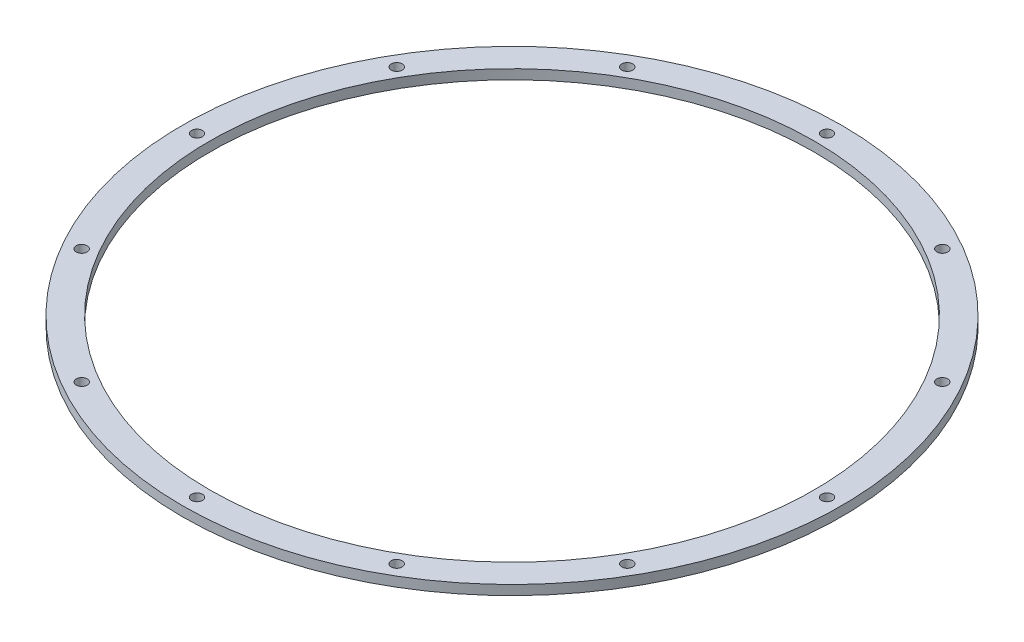
ISO-10303-21;
HEADER;
FILE_DESCRIPTION(('STEP AP214'),'2;1');
FILE_NAME('part.step','',(''),(''),'','','');
FILE_SCHEMA(('AUTOMOTIVE_DESIGN { 1 0 10303 214 1 1 1 1 }'));
ENDSEC;
DATA;
#1=APPLICATION_CONTEXT('core data for automotive mechanical design processes');
#2=APPLICATION_PROTOCOL_DEFINITION('international standard','automotive_design',2000,#1);
#3=PRODUCT_CONTEXT('',#1,'mechanical');
#4=PRODUCT('Part','Part','',(#3));
#5=PRODUCT_RELATED_PRODUCT_CATEGORY('part','',(#4));
#6=PRODUCT_DEFINITION_FORMATION('','',#4);
#7=PRODUCT_DEFINITION_CONTEXT('part definition',#1,'design');
#8=PRODUCT_DEFINITION('design','',#6,#7);
#9=PRODUCT_DEFINITION_SHAPE('','',#8);
#10=(LENGTH_UNIT() NAMED_UNIT(*) SI_UNIT(.MILLI.,.METRE.));
#11=(NAMED_UNIT(*) PLANE_ANGLE_UNIT() SI_UNIT($,.RADIAN.));
#12=(NAMED_UNIT(*) SI_UNIT($,.STERADIAN.) SOLID_ANGLE_UNIT());
#13=UNCERTAINTY_MEASURE_WITH_UNIT(LENGTH_MEASURE(1.E-05),#10,'distance_accuracy_value','');
#14=(GEOMETRIC_REPRESENTATION_CONTEXT(3) GLOBAL_UNCERTAINTY_ASSIGNED_CONTEXT((#13)) GLOBAL_UNIT_ASSIGNED_CONTEXT((#10,
#11,#12)) REPRESENTATION_CONTEXT('',''));
#15=CARTESIAN_POINT('',(0.,0.,0.));
#16=DIRECTION('',(0.,0.,1.));
#17=DIRECTION('',(1.,0.,0.));
#18=AXIS2_PLACEMENT_3D('',#15,#16,#17);
#19=CARTESIAN_POINT('',(0.,3.,0.));
#20=DIRECTION('',(0.,-1.,0.));
#21=DIRECTION('',(0.,0.,-1.));
#22=AXIS2_PLACEMENT_3D('',#19,#20,#21);
#23=CYLINDRICAL_SURFACE('',#22,94.);
#24=CARTESIAN_POINT('',(0.,3.,0.));
#25=DIRECTION('',(0.,1.,0.));
#26=DIRECTION('',(0.,0.,1.));
#27=AXIS2_PLACEMENT_3D('',#24,#25,#26);
#28=CIRCLE('',#27,94.);
#29=CARTESIAN_POINT('',(0.,3.,94.));
#30=VERTEX_POINT('',#29);
#31=EDGE_CURVE('E40',#30,#30,#28,.T.);
#32=ORIENTED_EDGE('',*,*,#31,.T.);
#33=EDGE_LOOP('',(#32));
#34=FACE_BOUND('',#33,.T.);
#35=CARTESIAN_POINT('',(0.,0.,0.));
#36=DIRECTION('',(0.,1.,0.));
#37=DIRECTION('',(0.,0.,1.));
#38=AXIS2_PLACEMENT_3D('',#35,#36,#37);
#39=CIRCLE('',#38,94.);
#40=CARTESIAN_POINT('',(0.,0.,94.));
#41=VERTEX_POINT('',#40);
#42=EDGE_CURVE('E84',#41,#41,#39,.T.);
#43=ORIENTED_EDGE('',*,*,#42,.F.);
#44=EDGE_LOOP('',(#43));
#45=FACE_BOUND('',#44,.T.);
#46=ADVANCED_FACE('F32',(#34,#45),#23,.F.);
#47=CARTESIAN_POINT('',(0.,3.,-97.974));
#48=DIRECTION('',(0.,-1.,0.));
#49=DIRECTION('',(0.,0.,-1.));
#50=AXIS2_PLACEMENT_3D('',#47,#48,#49);
#51=CYLINDRICAL_SURFACE('',#50,1.70000000000001);
#52=CARTESIAN_POINT('',(0.,3.,-97.974));
#53=DIRECTION('',(0.,1.,0.));
#54=DIRECTION('',(0.,0.,1.));
#55=AXIS2_PLACEMENT_3D('',#52,#53,#54);
#56=CIRCLE('',#55,1.70000000000001);
#57=CARTESIAN_POINT('',(0.,3.,-96.274));
#58=VERTEX_POINT('',#57);
#59=EDGE_CURVE('E45',#58,#58,#56,.T.);
#60=ORIENTED_EDGE('',*,*,#59,.T.);
#61=EDGE_LOOP('',(#60));
#62=FACE_BOUND('',#61,.T.);
#63=CARTESIAN_POINT('',(0.,0.,-97.974));
#64=DIRECTION('',(0.,1.,0.));
#65=DIRECTION('',(0.,0.,1.));
#66=AXIS2_PLACEMENT_3D('',#63,#64,#65);
#67=CIRCLE('',#66,1.70000000000001);
#68=CARTESIAN_POINT('',(0.,0.,-96.274));
#69=VERTEX_POINT('',#68);
#70=EDGE_CURVE('E82',#69,#69,#67,.T.);
#71=ORIENTED_EDGE('',*,*,#70,.F.);
#72=EDGE_LOOP('',(#71));
#73=FACE_BOUND('',#72,.T.);
#74=ADVANCED_FACE('F129',(#62,#73),#51,.F.);
#75=CARTESIAN_POINT('',(48.9870000000005,3.,-84.8479729103784));
#76=DIRECTION('',(0.,-1.,0.));
#77=DIRECTION('',(0.,0.,-1.));
#78=AXIS2_PLACEMENT_3D('',#75,#76,#77);
#79=CYLINDRICAL_SURFACE('',#78,1.7);
#80=CARTESIAN_POINT('',(48.9870000000005,3.,-84.8479729103784));
#81=DIRECTION('',(0.,1.,0.));
#82=DIRECTION('',(0.,0.,1.));
#83=AXIS2_PLACEMENT_3D('',#80,#81,#82);
#84=CIRCLE('',#83,1.7);
#85=CARTESIAN_POINT('',(48.9870000000005,3.,-83.1479729103784));
#86=VERTEX_POINT('',#85);
#87=EDGE_CURVE('E124',#86,#86,#84,.T.);
#88=ORIENTED_EDGE('',*,*,#87,.T.);
#89=EDGE_LOOP('',(#88));
#90=FACE_BOUND('',#89,.T.);
#91=CARTESIAN_POINT('',(48.9870000000005,0.,-84.8479729103784));
#92=DIRECTION('',(0.,1.,0.));
#93=DIRECTION('',(0.,0.,1.));
#94=AXIS2_PLACEMENT_3D('',#91,#92,#93);
#95=CIRCLE('',#94,1.7);
#96=CARTESIAN_POINT('',(48.9870000000005,0.,-83.1479729103784));
#97=VERTEX_POINT('',#96);
#98=EDGE_CURVE('E79',#97,#97,#95,.T.);
#99=ORIENTED_EDGE('',*,*,#98,.F.);
#100=EDGE_LOOP('',(#99));
#101=FACE_BOUND('',#100,.T.);
#102=ADVANCED_FACE('F147',(#90,#101),#79,.F.);
#103=CARTESIAN_POINT('',(84.8479729103784,3.,-48.9870000000031));
#104=DIRECTION('',(0.,-1.,0.));
#105=DIRECTION('',(0.,0.,-1.));
#106=AXIS2_PLACEMENT_3D('',#103,#104,#105);
#107=CYLINDRICAL_SURFACE('',#106,1.7);
#108=CARTESIAN_POINT('',(84.8479729103784,3.,-48.9870000000031));
#109=DIRECTION('',(0.,1.,0.));
#110=DIRECTION('',(0.,0.,1.));
#111=AXIS2_PLACEMENT_3D('',#108,#109,#110);
#112=CIRCLE('',#111,1.7);
#113=CARTESIAN_POINT('',(84.8479729103784,3.,-47.2870000000031));
#114=VERTEX_POINT('',#113);
#115=EDGE_CURVE('E121',#114,#114,#112,.T.);
#116=ORIENTED_EDGE('',*,*,#115,.T.);
#117=EDGE_LOOP('',(#116));
#118=FACE_BOUND('',#117,.T.);
#119=CARTESIAN_POINT('',(84.8479729103784,0.,-48.9870000000031));
#120=DIRECTION('',(0.,1.,0.));
#121=DIRECTION('',(0.,0.,1.));
#122=AXIS2_PLACEMENT_3D('',#119,#120,#121);
#123=CIRCLE('',#122,1.7);
#124=CARTESIAN_POINT('',(84.8479729103784,0.,-47.2870000000031));
#125=VERTEX_POINT('',#124);
#126=EDGE_CURVE('E76',#125,#125,#123,.T.);
#127=ORIENTED_EDGE('',*,*,#126,.F.);
#128=EDGE_LOOP('',(#127));
#129=FACE_BOUND('',#128,.T.);
#130=ADVANCED_FACE('F154',(#118,#129),#107,.F.);
#131=CARTESIAN_POINT('',(97.9740000000036,3.,-3.60894813406599E-12));
#132=DIRECTION('',(0.,-1.,0.));
#133=DIRECTION('',(0.,0.,-1.));
#134=AXIS2_PLACEMENT_3D('',#131,#132,#133);
#135=CYLINDRICAL_SURFACE('',#134,1.7);
#136=CARTESIAN_POINT('',(97.9740000000036,3.,-3.60894813406599E-12));
#137=DIRECTION('',(0.,1.,0.));
#138=DIRECTION('',(0.,0.,1.));
#139=AXIS2_PLACEMENT_3D('',#136,#137,#138);
#140=CIRCLE('',#139,1.7);
#141=CARTESIAN_POINT('',(97.9740000000036,3.,1.69999999999639));
#142=VERTEX_POINT('',#141);
#143=EDGE_CURVE('E118',#142,#142,#140,.T.);
#144=ORIENTED_EDGE('',*,*,#143,.T.);
#145=EDGE_LOOP('',(#144));
#146=FACE_BOUND('',#145,.T.);
#147=CARTESIAN_POINT('',(97.9740000000036,0.,-3.60894813406599E-12));
#148=DIRECTION('',(0.,1.,0.));
#149=DIRECTION('',(0.,0.,1.));
#150=AXIS2_PLACEMENT_3D('',#147,#148,#149);
#151=CIRCLE('',#150,1.7);
#152=CARTESIAN_POINT('',(97.9740000000036,0.,1.69999999999639));
#153=VERTEX_POINT('',#152);
#154=EDGE_CURVE('E73',#153,#153,#151,.T.);
#155=ORIENTED_EDGE('',*,*,#154,.F.);
#156=EDGE_LOOP('',(#155));
#157=FACE_BOUND('',#156,.T.);
#158=ADVANCED_FACE('F158',(#146,#157),#135,.F.);
#159=CARTESIAN_POINT('',(84.847972910382,3.,48.9869999999969));
#160=DIRECTION('',(0.,-1.,0.));
#161=DIRECTION('',(0.,0.,-1.));
#162=AXIS2_PLACEMENT_3D('',#159,#160,#161);
#163=CYLINDRICAL_SURFACE('',#162,1.7);
#164=CARTESIAN_POINT('',(84.847972910382,3.,48.9869999999969));
#165=DIRECTION('',(0.,1.,0.));
#166=DIRECTION('',(0.,0.,1.));
#167=AXIS2_PLACEMENT_3D('',#164,#165,#166);
#168=CIRCLE('',#167,1.7);
#169=CARTESIAN_POINT('',(84.847972910382,3.,50.6869999999969));
#170=VERTEX_POINT('',#169);
#171=EDGE_CURVE('E115',#170,#170,#168,.T.);
#172=ORIENTED_EDGE('',*,*,#171,.T.);
#173=EDGE_LOOP('',(#172));
#174=FACE_BOUND('',#173,.T.);
#175=CARTESIAN_POINT('',(84.847972910382,0.,48.9869999999969));
#176=DIRECTION('',(0.,1.,0.));
#177=DIRECTION('',(0.,0.,1.));
#178=AXIS2_PLACEMENT_3D('',#175,#176,#177);
#179=CIRCLE('',#178,1.7);
#180=CARTESIAN_POINT('',(84.847972910382,0.,50.6869999999969));
#181=VERTEX_POINT('',#180);
#182=EDGE_CURVE('E70',#181,#181,#179,.T.);
#183=ORIENTED_EDGE('',*,*,#182,.F.);
#184=EDGE_LOOP('',(#183));
#185=FACE_BOUND('',#184,.T.);
#186=ADVANCED_FACE('F162',(#174,#185),#163,.F.);
#187=CARTESIAN_POINT('',(48.9870000000068,3.,84.8479729103748));
#188=DIRECTION('',(0.,-1.,0.));
#189=DIRECTION('',(0.,0.,-1.));
#190=AXIS2_PLACEMENT_3D('',#187,#188,#189);
#191=CYLINDRICAL_SURFACE('',#190,1.7);
#192=CARTESIAN_POINT('',(48.9870000000068,3.,84.8479729103748));
#193=DIRECTION('',(0.,1.,0.));
#194=DIRECTION('',(0.,0.,1.));
#195=AXIS2_PLACEMENT_3D('',#192,#193,#194);
#196=CIRCLE('',#195,1.7);
#197=CARTESIAN_POINT('',(48.9870000000068,3.,86.5479729103748));
#198=VERTEX_POINT('',#197);
#199=EDGE_CURVE('E112',#198,#198,#196,.T.);
#200=ORIENTED_EDGE('',*,*,#199,.T.);
#201=EDGE_LOOP('',(#200));
#202=FACE_BOUND('',#201,.T.);
#203=CARTESIAN_POINT('',(48.9870000000068,0.,84.8479729103748));
#204=DIRECTION('',(0.,1.,0.));
#205=DIRECTION('',(0.,0.,1.));
#206=AXIS2_PLACEMENT_3D('',#203,#204,#205);
#207=CIRCLE('',#206,1.7);
#208=CARTESIAN_POINT('',(48.9870000000068,0.,86.5479729103748));
#209=VERTEX_POINT('',#208);
#210=EDGE_CURVE('E67',#209,#209,#207,.T.);
#211=ORIENTED_EDGE('',*,*,#210,.F.);
#212=EDGE_LOOP('',(#211));
#213=FACE_BOUND('',#212,.T.);
#214=ADVANCED_FACE('F166',(#202,#213),#191,.F.);
#215=CARTESIAN_POINT('',(7.21789626813198E-12,3.,97.974));
#216=DIRECTION('',(0.,-1.,0.));
#217=DIRECTION('',(0.,0.,-1.));
#218=AXIS2_PLACEMENT_3D('',#215,#216,#217);
#219=CYLINDRICAL_SURFACE('',#218,1.69999999999999);
#220=CARTESIAN_POINT('',(7.21789626813198E-12,3.,97.974));
#221=DIRECTION('',(0.,1.,0.));
#222=DIRECTION('',(0.,0.,1.));
#223=AXIS2_PLACEMENT_3D('',#220,#221,#222);
#224=CIRCLE('',#223,1.69999999999999);
#225=CARTESIAN_POINT('',(7.21789626813198E-12,3.,99.674));
#226=VERTEX_POINT('',#225);
#227=EDGE_CURVE('E109',#226,#226,#224,.T.);
#228=ORIENTED_EDGE('',*,*,#227,.T.);
#229=EDGE_LOOP('',(#228));
#230=FACE_BOUND('',#229,.T.);
#231=CARTESIAN_POINT('',(7.21789626813198E-12,0.,97.974));
#232=DIRECTION('',(0.,1.,0.));
#233=DIRECTION('',(0.,0.,1.));
#234=AXIS2_PLACEMENT_3D('',#231,#232,#233);
#235=CIRCLE('',#234,1.69999999999999);
#236=CARTESIAN_POINT('',(7.21789626813198E-12,0.,99.674));
#237=VERTEX_POINT('',#236);
#238=EDGE_CURVE('E64',#237,#237,#235,.T.);
#239=ORIENTED_EDGE('',*,*,#238,.F.);
#240=EDGE_LOOP('',(#239));
#241=FACE_BOUND('',#240,.T.);
#242=ADVANCED_FACE('F170',(#230,#241),#219,.F.);
#243=CARTESIAN_POINT('',(-48.9869999999933,3.,84.8479729103784));
#244=DIRECTION('',(0.,-1.,0.));
#245=DIRECTION('',(0.,0.,-1.));
#246=AXIS2_PLACEMENT_3D('',#243,#244,#245);
#247=CYLINDRICAL_SURFACE('',#246,1.7);
#248=CARTESIAN_POINT('',(-48.9869999999933,3.,84.8479729103784));
#249=DIRECTION('',(0.,1.,0.));
#250=DIRECTION('',(0.,0.,1.));
#251=AXIS2_PLACEMENT_3D('',#248,#249,#250);
#252=CIRCLE('',#251,1.7);
#253=CARTESIAN_POINT('',(-48.9869999999933,3.,86.5479729103784));
#254=VERTEX_POINT('',#253);
#255=EDGE_CURVE('E106',#254,#254,#252,.T.);
#256=ORIENTED_EDGE('',*,*,#255,.T.);
#257=EDGE_LOOP('',(#256));
#258=FACE_BOUND('',#257,.T.);
#259=CARTESIAN_POINT('',(-48.9869999999933,0.,84.8479729103784));
#260=DIRECTION('',(0.,1.,0.));
#261=DIRECTION('',(0.,0.,1.));
#262=AXIS2_PLACEMENT_3D('',#259,#260,#261);
#263=CIRCLE('',#262,1.7);
#264=CARTESIAN_POINT('',(-48.9869999999933,0.,86.5479729103784));
#265=VERTEX_POINT('',#264);
#266=EDGE_CURVE('E61',#265,#265,#263,.T.);
#267=ORIENTED_EDGE('',*,*,#266,.F.);
#268=EDGE_LOOP('',(#267));
#269=FACE_BOUND('',#268,.T.);
#270=ADVANCED_FACE('F174',(#258,#269),#247,.F.);
#271=CARTESIAN_POINT('',(-84.8479729103712,3.,48.9870000000032));
#272=DIRECTION('',(0.,-1.,0.));
#273=DIRECTION('',(0.,0.,-1.));
#274=AXIS2_PLACEMENT_3D('',#271,#272,#273);
#275=CYLINDRICAL_SURFACE('',#274,1.7);
#276=CARTESIAN_POINT('',(-84.8479729103712,3.,48.9870000000032));
#277=DIRECTION('',(0.,1.,0.));
#278=DIRECTION('',(0.,0.,1.));
#279=AXIS2_PLACEMENT_3D('',#276,#277,#278);
#280=CIRCLE('',#279,1.7);
#281=CARTESIAN_POINT('',(-84.8479729103712,3.,50.6870000000032));
#282=VERTEX_POINT('',#281);
#283=EDGE_CURVE('E103',#282,#282,#280,.T.);
#284=ORIENTED_EDGE('',*,*,#283,.T.);
#285=EDGE_LOOP('',(#284));
#286=FACE_BOUND('',#285,.T.);
#287=CARTESIAN_POINT('',(-84.8479729103712,0.,48.9870000000032));
#288=DIRECTION('',(0.,1.,0.));
#289=DIRECTION('',(0.,0.,1.));
#290=AXIS2_PLACEMENT_3D('',#287,#288,#289);
#291=CIRCLE('',#290,1.7);
#292=CARTESIAN_POINT('',(-84.8479729103712,0.,50.6870000000032));
#293=VERTEX_POINT('',#292);
#294=EDGE_CURVE('E58',#293,#293,#291,.T.);
#295=ORIENTED_EDGE('',*,*,#294,.F.);
#296=EDGE_LOOP('',(#295));
#297=FACE_BOUND('',#296,.T.);
#298=ADVANCED_FACE('F178',(#286,#297),#275,.F.);
#299=CARTESIAN_POINT('',(-97.9739999999964,3.,3.62094648861596E-12));
#300=DIRECTION('',(0.,-1.,0.));
#301=DIRECTION('',(0.,0.,-1.));
#302=AXIS2_PLACEMENT_3D('',#299,#300,#301);
#303=CYLINDRICAL_SURFACE('',#302,1.7);
#304=CARTESIAN_POINT('',(-97.9739999999964,3.,3.62094648861596E-12));
#305=DIRECTION('',(0.,1.,0.));
#306=DIRECTION('',(0.,0.,1.));
#307=AXIS2_PLACEMENT_3D('',#304,#305,#306);
#308=CIRCLE('',#307,1.7);
#309=CARTESIAN_POINT('',(-97.9739999999964,3.,1.70000000000362));
#310=VERTEX_POINT('',#309);
#311=EDGE_CURVE('E98',#310,#310,#308,.T.);
#312=ORIENTED_EDGE('',*,*,#311,.T.);
#313=EDGE_LOOP('',(#312));
#314=FACE_BOUND('',#313,.T.);
#315=CARTESIAN_POINT('',(-97.9739999999964,0.,3.62094648861596E-12));
#316=DIRECTION('',(0.,1.,0.));
#317=DIRECTION('',(0.,0.,1.));
#318=AXIS2_PLACEMENT_3D('',#315,#316,#317);
#319=CIRCLE('',#318,1.7);
#320=CARTESIAN_POINT('',(-97.9739999999964,0.,1.70000000000362));
#321=VERTEX_POINT('',#320);
#322=EDGE_CURVE('E55',#321,#321,#319,.T.);
#323=ORIENTED_EDGE('',*,*,#322,.F.);
#324=EDGE_LOOP('',(#323));
#325=FACE_BOUND('',#324,.T.);
#326=ADVANCED_FACE('F182',(#314,#325),#303,.F.);
#327=CARTESIAN_POINT('',(-84.8479729103748,3.,-48.9869999999968));
#328=DIRECTION('',(0.,-1.,0.));
#329=DIRECTION('',(0.,0.,-1.));
#330=AXIS2_PLACEMENT_3D('',#327,#328,#329);
#331=CYLINDRICAL_SURFACE('',#330,1.7);
#332=CARTESIAN_POINT('',(-84.8479729103748,3.,-48.9869999999968));
#333=DIRECTION('',(0.,1.,0.));
#334=DIRECTION('',(0.,0.,1.));
#335=AXIS2_PLACEMENT_3D('',#332,#333,#334);
#336=CIRCLE('',#335,1.7);
#337=CARTESIAN_POINT('',(-84.8479729103748,3.,-47.2869999999968));
#338=VERTEX_POINT('',#337);
#339=EDGE_CURVE('E93',#338,#338,#336,.T.);
#340=ORIENTED_EDGE('',*,*,#339,.T.);
#341=EDGE_LOOP('',(#340));
#342=FACE_BOUND('',#341,.T.);
#343=CARTESIAN_POINT('',(-84.8479729103748,0.,-48.9869999999968));
#344=DIRECTION('',(0.,1.,0.));
#345=DIRECTION('',(0.,0.,1.));
#346=AXIS2_PLACEMENT_3D('',#343,#344,#345);
#347=CIRCLE('',#346,1.7);
#348=CARTESIAN_POINT('',(-84.8479729103748,0.,-47.2869999999968));
#349=VERTEX_POINT('',#348);
#350=EDGE_CURVE('E52',#349,#349,#347,.T.);
#351=ORIENTED_EDGE('',*,*,#350,.F.);
#352=EDGE_LOOP('',(#351));
#353=FACE_BOUND('',#352,.T.);
#354=ADVANCED_FACE('F185',(#342,#353),#331,.F.);
#355=CARTESIAN_POINT('',(-48.9869999999996,3.,-84.8479729103748));
#356=DIRECTION('',(0.,-1.,0.));
#357=DIRECTION('',(0.,0.,-1.));
#358=AXIS2_PLACEMENT_3D('',#355,#356,#357);
#359=CYLINDRICAL_SURFACE('',#358,1.7);
#360=CARTESIAN_POINT('',(-48.9869999999996,3.,-84.8479729103748));
#361=DIRECTION('',(0.,1.,0.));
#362=DIRECTION('',(0.,0.,1.));
#363=AXIS2_PLACEMENT_3D('',#360,#361,#362);
#364=CIRCLE('',#363,1.7);
#365=CARTESIAN_POINT('',(-48.9869999999996,3.,-83.1479729103748));
#366=VERTEX_POINT('',#365);
#367=EDGE_CURVE('E89',#366,#366,#364,.T.);
#368=ORIENTED_EDGE('',*,*,#367,.T.);
#369=EDGE_LOOP('',(#368));
#370=FACE_BOUND('',#369,.T.);
#371=CARTESIAN_POINT('',(-48.9869999999996,0.,-84.8479729103748));
#372=DIRECTION('',(0.,1.,0.));
#373=DIRECTION('',(0.,0.,1.));
#374=AXIS2_PLACEMENT_3D('',#371,#372,#373);
#375=CIRCLE('',#374,1.7);
#376=CARTESIAN_POINT('',(-48.9869999999996,0.,-83.1479729103748));
#377=VERTEX_POINT('',#376);
#378=EDGE_CURVE('E49',#377,#377,#375,.T.);
#379=ORIENTED_EDGE('',*,*,#378,.F.);
#380=EDGE_LOOP('',(#379));
#381=FACE_BOUND('',#380,.T.);
#382=ADVANCED_FACE('F34',(#370,#381),#359,.F.);
#383=CARTESIAN_POINT('',(0.,3.,0.));
#384=DIRECTION('',(0.,-1.,0.));
#385=DIRECTION('',(0.,0.,-1.));
#386=AXIS2_PLACEMENT_3D('',#383,#384,#385);
#387=CYLINDRICAL_SURFACE('',#386,102.5);
#388=CARTESIAN_POINT('',(0.,3.,0.));
#389=DIRECTION('',(0.,1.,0.));
#390=DIRECTION('',(0.,0.,1.));
#391=AXIS2_PLACEMENT_3D('',#388,#389,#390);
#392=CIRCLE('',#391,102.5);
#393=CARTESIAN_POINT('',(0.,3.,102.5));
#394=VERTEX_POINT('',#393);
#395=EDGE_CURVE('E10',#394,#394,#392,.T.);
#396=ORIENTED_EDGE('',*,*,#395,.F.);
#397=EDGE_LOOP('',(#396));
#398=FACE_BOUND('',#397,.T.);
#399=CARTESIAN_POINT('',(0.,0.,0.));
#400=DIRECTION('',(0.,1.,0.));
#401=DIRECTION('',(0.,0.,1.));
#402=AXIS2_PLACEMENT_3D('',#399,#400,#401);
#403=CIRCLE('',#402,102.5);
#404=CARTESIAN_POINT('',(0.,0.,102.5));
#405=VERTEX_POINT('',#404);
#406=EDGE_CURVE('E36',#405,#405,#403,.T.);
#407=ORIENTED_EDGE('',*,*,#406,.T.);
#408=EDGE_LOOP('',(#407));
#409=FACE_BOUND('',#408,.T.);
#410=ADVANCED_FACE('F136',(#398,#409),#387,.T.);
#411=CARTESIAN_POINT('',(0.,3.,0.));
#412=DIRECTION('',(0.,1.,0.));
#413=DIRECTION('',(0.,0.,1.));
#414=AXIS2_PLACEMENT_3D('',#411,#412,#413);
#415=PLANE('',#414);
#416=ORIENTED_EDGE('',*,*,#367,.F.);
#417=EDGE_LOOP('',(#416));
#418=FACE_BOUND('',#417,.T.);
#419=ORIENTED_EDGE('',*,*,#339,.F.);
#420=EDGE_LOOP('',(#419));
#421=FACE_BOUND('',#420,.T.);
#422=ORIENTED_EDGE('',*,*,#311,.F.);
#423=EDGE_LOOP('',(#422));
#424=FACE_BOUND('',#423,.T.);
#425=ORIENTED_EDGE('',*,*,#283,.F.);
#426=EDGE_LOOP('',(#425));
#427=FACE_BOUND('',#426,.T.);
#428=ORIENTED_EDGE('',*,*,#255,.F.);
#429=EDGE_LOOP('',(#428));
#430=FACE_BOUND('',#429,.T.);
#431=ORIENTED_EDGE('',*,*,#227,.F.);
#432=EDGE_LOOP('',(#431));
#433=FACE_BOUND('',#432,.T.);
#434=ORIENTED_EDGE('',*,*,#199,.F.);
#435=EDGE_LOOP('',(#434));
#436=FACE_BOUND('',#435,.T.);
#437=ORIENTED_EDGE('',*,*,#171,.F.);
#438=EDGE_LOOP('',(#437));
#439=FACE_BOUND('',#438,.T.);
#440=ORIENTED_EDGE('',*,*,#143,.F.);
#441=EDGE_LOOP('',(#440));
#442=FACE_BOUND('',#441,.T.);
#443=ORIENTED_EDGE('',*,*,#115,.F.);
#444=EDGE_LOOP('',(#443));
#445=FACE_BOUND('',#444,.T.);
#446=ORIENTED_EDGE('',*,*,#87,.F.);
#447=EDGE_LOOP('',(#446));
#448=FACE_BOUND('',#447,.T.);
#449=ORIENTED_EDGE('',*,*,#59,.F.);
#450=EDGE_LOOP('',(#449));
#451=FACE_BOUND('',#450,.T.);
#452=ORIENTED_EDGE('',*,*,#31,.F.);
#453=EDGE_LOOP('',(#452));
#454=FACE_BOUND('',#453,.T.);
#455=ORIENTED_EDGE('',*,*,#395,.T.);
#456=EDGE_LOOP('',(#455));
#457=FACE_BOUND('',#456,.T.);
#458=ADVANCED_FACE('F132',(#418,#421,#424,#427,#430,#433,#436,#439,#442,#445,#448,#451,#454,
#457),#415,.T.);
#459=CARTESIAN_POINT('',(0.,0.,0.));
#460=DIRECTION('',(0.,1.,0.));
#461=DIRECTION('',(0.,0.,1.));
#462=AXIS2_PLACEMENT_3D('',#459,#460,#461);
#463=PLANE('',#462);
#464=ORIENTED_EDGE('',*,*,#378,.T.);
#465=EDGE_LOOP('',(#464));
#466=FACE_BOUND('',#465,.T.);
#467=ORIENTED_EDGE('',*,*,#350,.T.);
#468=EDGE_LOOP('',(#467));
#469=FACE_BOUND('',#468,.T.);
#470=ORIENTED_EDGE('',*,*,#322,.T.);
#471=EDGE_LOOP('',(#470));
#472=FACE_BOUND('',#471,.T.);
#473=ORIENTED_EDGE('',*,*,#294,.T.);
#474=EDGE_LOOP('',(#473));
#475=FACE_BOUND('',#474,.T.);
#476=ORIENTED_EDGE('',*,*,#266,.T.);
#477=EDGE_LOOP('',(#476));
#478=FACE_BOUND('',#477,.T.);
#479=ORIENTED_EDGE('',*,*,#238,.T.);
#480=EDGE_LOOP('',(#479));
#481=FACE_BOUND('',#480,.T.);
#482=ORIENTED_EDGE('',*,*,#210,.T.);
#483=EDGE_LOOP('',(#482));
#484=FACE_BOUND('',#483,.T.);
#485=ORIENTED_EDGE('',*,*,#182,.T.);
#486=EDGE_LOOP('',(#485));
#487=FACE_BOUND('',#486,.T.);
#488=ORIENTED_EDGE('',*,*,#154,.T.);
#489=EDGE_LOOP('',(#488));
#490=FACE_BOUND('',#489,.T.);
#491=ORIENTED_EDGE('',*,*,#126,.T.);
#492=EDGE_LOOP('',(#491));
#493=FACE_BOUND('',#492,.T.);
#494=ORIENTED_EDGE('',*,*,#98,.T.);
#495=EDGE_LOOP('',(#494));
#496=FACE_BOUND('',#495,.T.);
#497=ORIENTED_EDGE('',*,*,#70,.T.);
#498=EDGE_LOOP('',(#497));
#499=FACE_BOUND('',#498,.T.);
#500=ORIENTED_EDGE('',*,*,#42,.T.);
#501=EDGE_LOOP('',(#500));
#502=FACE_BOUND('',#501,.T.);
#503=ORIENTED_EDGE('',*,*,#406,.F.);
#504=EDGE_LOOP('',(#503));
#505=FACE_BOUND('',#504,.T.);
#506=ADVANCED_FACE('F135',(#466,#469,#472,#475,#478,#481,#484,#487,#490,#493,#496,#499,#502,
#505),#463,.F.);
#507=CLOSED_SHELL('',(#46,#74,#102,#130,#158,#186,#214,#242,#270,#298,#326,#354,#382,#410,#458,#506));
#508=MANIFOLD_SOLID_BREP('B2',#507);
#509=ADVANCED_BREP_SHAPE_REPRESENTATION('',(#18,#508),#14);
#510=SHAPE_DEFINITION_REPRESENTATION(#9,#509);
ENDSEC;
END-ISO-10303-21;
